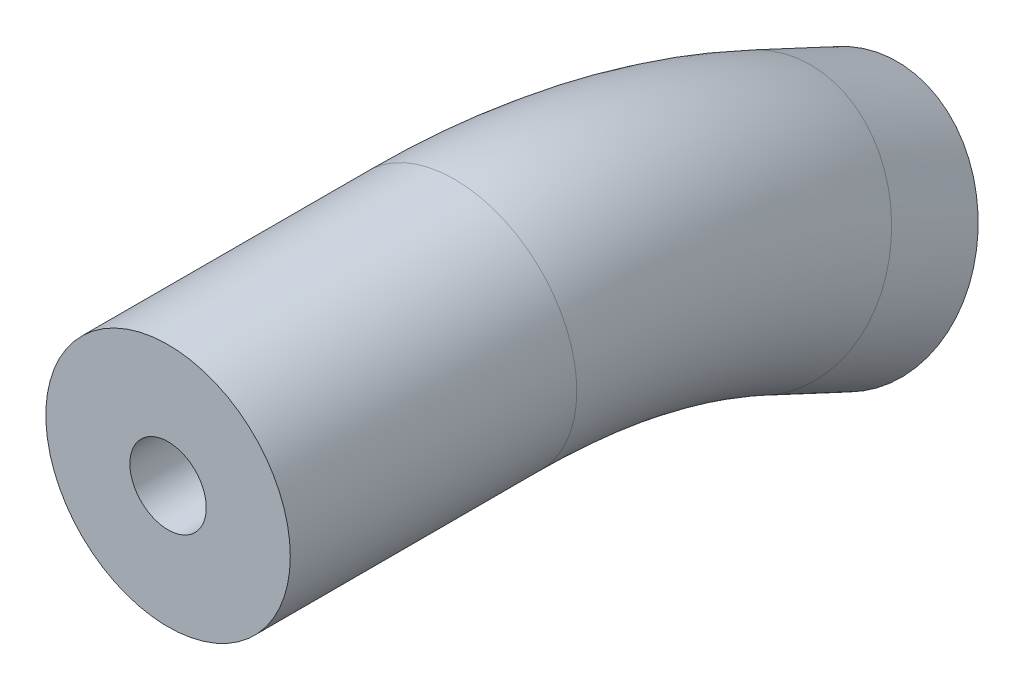
ISO-10303-21;
HEADER;
FILE_DESCRIPTION(('STEP AP214'),'2;1');
FILE_NAME('part.step','',(''),(''),'','','');
FILE_SCHEMA(('AUTOMOTIVE_DESIGN { 1 0 10303 214 1 1 1 1 }'));
ENDSEC;
DATA;
#1=APPLICATION_CONTEXT('core data for automotive mechanical design processes');
#2=APPLICATION_PROTOCOL_DEFINITION('international standard','automotive_design',2000,#1);
#3=PRODUCT_CONTEXT('',#1,'mechanical');
#4=PRODUCT('Part','Part','',(#3));
#5=PRODUCT_RELATED_PRODUCT_CATEGORY('part','',(#4));
#6=PRODUCT_DEFINITION_FORMATION('','',#4);
#7=PRODUCT_DEFINITION_CONTEXT('part definition',#1,'design');
#8=PRODUCT_DEFINITION('design','',#6,#7);
#9=PRODUCT_DEFINITION_SHAPE('','',#8);
#10=(LENGTH_UNIT() NAMED_UNIT(*) SI_UNIT(.MILLI.,.METRE.));
#11=(NAMED_UNIT(*) PLANE_ANGLE_UNIT() SI_UNIT($,.RADIAN.));
#12=(NAMED_UNIT(*) SI_UNIT($,.STERADIAN.) SOLID_ANGLE_UNIT());
#13=UNCERTAINTY_MEASURE_WITH_UNIT(LENGTH_MEASURE(1.E-05),#10,'distance_accuracy_value','');
#14=(GEOMETRIC_REPRESENTATION_CONTEXT(3) GLOBAL_UNCERTAINTY_ASSIGNED_CONTEXT((#13)) GLOBAL_UNIT_ASSIGNED_CONTEXT((#10,
#11,#12)) REPRESENTATION_CONTEXT('',''));
#15=CARTESIAN_POINT('',(0.,0.,0.));
#16=DIRECTION('',(0.,0.,1.));
#17=DIRECTION('',(1.,0.,0.));
#18=AXIS2_PLACEMENT_3D('',#15,#16,#17);
#19=CARTESIAN_POINT('',(8.125,-4.2,-8.02));
#20=DIRECTION('',(0.,0.,-1.));
#21=DIRECTION('',(-1.,0.,0.));
#22=AXIS2_PLACEMENT_3D('',#19,#20,#21);
#23=CYLINDRICAL_SURFACE('',#22,0.2);
#24=CARTESIAN_POINT('',(8.125,-4.2,-9.52));
#25=DIRECTION('',(0.,0.,1.));
#26=DIRECTION('',(1.,0.,0.));
#27=AXIS2_PLACEMENT_3D('',#24,#25,#26);
#28=CIRCLE('',#27,0.2);
#29=CARTESIAN_POINT('',(8.325,-4.2,-9.52));
#30=VERTEX_POINT('',#29);
#31=EDGE_CURVE('E62',#30,#30,#28,.T.);
#32=ORIENTED_EDGE('',*,*,#31,.F.);
#33=EDGE_LOOP('',(#32));
#34=FACE_BOUND('',#33,.T.);
#35=CARTESIAN_POINT('',(8.125,-4.2,-8.02));
#36=DIRECTION('',(0.,0.,-1.));
#37=DIRECTION('',(-1.,0.,0.));
#38=AXIS2_PLACEMENT_3D('',#35,#36,#37);
#39=CIRCLE('',#38,0.2);
#40=CARTESIAN_POINT('',(7.925,-4.2,-8.02));
#41=VERTEX_POINT('',#40);
#42=EDGE_CURVE('E56',#41,#41,#39,.T.);
#43=ORIENTED_EDGE('',*,*,#42,.F.);
#44=EDGE_LOOP('',(#43));
#45=FACE_BOUND('',#44,.T.);
#46=ADVANCED_FACE('F17',(#34,#45),#23,.F.);
#47=CARTESIAN_POINT('',(8.125,-7.97099703639013,-9.52));
#48=DIRECTION('',(1.,0.,0.));
#49=DIRECTION('',(0.,0.,-1.));
#50=AXIS2_PLACEMENT_3D('',#47,#48,#49);
#51=TOROIDAL_SURFACE('',#50,3.77099703639014,0.200000000000004);
#52=ORIENTED_EDGE('',*,*,#31,.T.);
#53=EDGE_LOOP('',(#52));
#54=FACE_BOUND('',#53,.T.);
#55=CARTESIAN_POINT('',(8.12500000000001,-4.55331305739741,-11.1136922125105));
#56=DIRECTION('',(0.,0.422618261740958,0.906307787036529));
#57=DIRECTION('',(0.,-0.906307787036529,0.422618261740959));
#58=AXIS2_PLACEMENT_3D('',#55,#56,#57);
#59=CIRCLE('',#58,0.200000000000016);
#60=CARTESIAN_POINT('',(8.12500000000001,-4.73457461480473,-11.0291685601623));
#61=VERTEX_POINT('',#60);
#62=EDGE_CURVE('E53',#61,#61,#59,.T.);
#63=ORIENTED_EDGE('',*,*,#62,.F.);
#64=EDGE_LOOP('',(#63));
#65=FACE_BOUND('',#64,.T.);
#66=ADVANCED_FACE('F66',(#54,#65),#51,.F.);
#67=CARTESIAN_POINT('',(8.766,-3.559,-8.02));
#68=DIRECTION('',(0.,0.,1.));
#69=DIRECTION('',(-1.,0.,0.));
#70=AXIS2_PLACEMENT_3D('',#67,#68,#69);
#71=PLANE('',#70);
#72=ORIENTED_EDGE('',*,*,#42,.T.);
#73=EDGE_LOOP('',(#72));
#74=FACE_BOUND('',#73,.T.);
#75=CARTESIAN_POINT('',(8.125,-4.2,-8.02));
#76=DIRECTION('',(0.,0.,1.));
#77=DIRECTION('',(1.,0.,0.));
#78=AXIS2_PLACEMENT_3D('',#75,#76,#77);
#79=CIRCLE('',#78,0.64);
#80=CARTESIAN_POINT('',(8.765,-4.2,-8.02));
#81=VERTEX_POINT('',#80);
#82=EDGE_CURVE('E48',#81,#81,#79,.F.);
#83=ORIENTED_EDGE('',*,*,#82,.F.);
#84=EDGE_LOOP('',(#83));
#85=FACE_BOUND('',#84,.T.);
#86=ADVANCED_FACE('F74',(#74,#85),#71,.T.);
#87=CARTESIAN_POINT('',(8.12500000000001,-4.55331305739741,-11.1136922125105));
#88=DIRECTION('',(0.,-0.422618261740959,-0.906307787036529));
#89=DIRECTION('',(0.,0.906307787036529,-0.422618261740959));
#90=AXIS2_PLACEMENT_3D('',#87,#88,#89);
#91=CYLINDRICAL_SURFACE('',#90,0.200000000000016);
#92=CARTESIAN_POINT('',(8.12500000000002,-4.76462218847881,-11.5668461064811));
#93=DIRECTION('',(0.,-0.422618261740959,-0.906307787036529));
#94=DIRECTION('',(0.,0.906307787036529,-0.422618261740959));
#95=AXIS2_PLACEMENT_3D('',#92,#93,#94);
#96=CIRCLE('',#95,0.200000000000016);
#97=CARTESIAN_POINT('',(8.12500000000002,-4.58336063107148,-11.6513697588293));
#98=VERTEX_POINT('',#97);
#99=EDGE_CURVE('E45',#98,#98,#96,.F.);
#100=ORIENTED_EDGE('',*,*,#99,.F.);
#101=EDGE_LOOP('',(#100));
#102=FACE_BOUND('',#101,.T.);
#103=ORIENTED_EDGE('',*,*,#62,.T.);
#104=EDGE_LOOP('',(#103));
#105=FACE_BOUND('',#104,.T.);
#106=ADVANCED_FACE('F77',(#102,#105),#91,.F.);
#107=CARTESIAN_POINT('',(8.125,-4.2,-9.52));
#108=DIRECTION('',(0.,0.,1.));
#109=DIRECTION('',(1.,0.,0.));
#110=AXIS2_PLACEMENT_3D('',#107,#108,#109);
#111=CYLINDRICAL_SURFACE('',#110,0.64);
#112=ORIENTED_EDGE('',*,*,#82,.T.);
#113=EDGE_LOOP('',(#112));
#114=FACE_BOUND('',#113,.T.);
#115=CARTESIAN_POINT('',(8.125,-4.2,-9.52));
#116=DIRECTION('',(0.,0.,-1.));
#117=DIRECTION('',(-1.,0.,0.));
#118=AXIS2_PLACEMENT_3D('',#115,#116,#117);
#119=CIRCLE('',#118,0.639999999999999);
#120=CARTESIAN_POINT('',(7.485,-4.2,-9.52));
#121=VERTEX_POINT('',#120);
#122=EDGE_CURVE('E36',#121,#121,#119,.T.);
#123=ORIENTED_EDGE('',*,*,#122,.F.);
#124=EDGE_LOOP('',(#123));
#125=FACE_BOUND('',#124,.T.);
#126=ADVANCED_FACE('F81',(#114,#125),#111,.T.);
#127=CARTESIAN_POINT('',(7.484,-4.18367889700396,-11.8377444122497));
#128=DIRECTION('',(0.,-0.422618261740863,-0.906307787036574));
#129=DIRECTION('',(1.,0.,0.));
#130=AXIS2_PLACEMENT_3D('',#127,#128,#129);
#131=PLANE('',#130);
#132=ORIENTED_EDGE('',*,*,#99,.T.);
#133=EDGE_LOOP('',(#132));
#134=FACE_BOUND('',#133,.T.);
#135=CARTESIAN_POINT('',(8.12500000000001,-4.76462218847872,-11.5668461064811));
#136=DIRECTION('',(0.,0.422618261740778,0.906307787036613));
#137=DIRECTION('',(0.,-0.906307787036613,0.422618261740778));
#138=AXIS2_PLACEMENT_3D('',#135,#136,#137);
#139=CIRCLE('',#138,0.640000000000003);
#140=CARTESIAN_POINT('',(8.12500000000001,-5.34465917218216,-11.296370418967));
#141=VERTEX_POINT('',#140);
#142=EDGE_CURVE('E26',#141,#141,#139,.T.);
#143=ORIENTED_EDGE('',*,*,#142,.F.);
#144=EDGE_LOOP('',(#143));
#145=FACE_BOUND('',#144,.T.);
#146=ADVANCED_FACE('F41',(#134,#145),#131,.T.);
#147=CARTESIAN_POINT('',(8.12500000000004,-7.97099703645936,-9.51999999998462));
#148=DIRECTION('',(1.,0.,0.));
#149=DIRECTION('',(0.,1.,0.));
#150=AXIS2_PLACEMENT_3D('',#147,#148,#149);
#151=TOROIDAL_SURFACE('',#150,3.77099703645937,0.640000000000001);
#152=CARTESIAN_POINT('',(8.125,-4.55331305739947,-11.1136922125096));
#153=DIRECTION('',(0.,0.422618261730355,0.906307787041474));
#154=DIRECTION('',(0.,-0.906307787041474,0.422618261730355));
#155=AXIS2_PLACEMENT_3D('',#152,#153,#154);
#156=CIRCLE('',#155,0.64);
#157=CARTESIAN_POINT('',(7.485,-4.55331305740871,-11.1136922125052));
#158=VERTEX_POINT('',#157);
#159=CARTESIAN_POINT('',(8.125,-5.13335004111153,-10.8432165250153));
#160=VERTEX_POINT('',#159);
#161=EDGE_CURVE('E33',#158,#160,#156,.T.);
#162=ORIENTED_EDGE('',*,*,#161,.T.);
#163=CARTESIAN_POINT('',(8.125,-4.5533130573974,-11.1136922125105));
#164=DIRECTION('',(0.,-0.422618261740916,-0.906307787036549));
#165=DIRECTION('',(0.,0.906307787036549,-0.422618261740916));
#166=AXIS2_PLACEMENT_3D('',#163,#164,#165);
#167=CIRCLE('',#166,0.640000000000016);
#168=EDGE_CURVE('E11',#158,#160,#167,.T.);
#169=ORIENTED_EDGE('',*,*,#168,.F.);
#170=EDGE_LOOP('',(#162,#169));
#171=FACE_BOUND('',#170,.T.);
#172=ORIENTED_EDGE('',*,*,#122,.T.);
#173=EDGE_LOOP('',(#172));
#174=FACE_BOUND('',#173,.T.);
#175=ADVANCED_FACE('F38',(#171,#174),#151,.T.);
#176=CARTESIAN_POINT('',(8.12500000000001,-4.7646221884443,-11.5668461064073));
#177=DIRECTION('',(0.,0.422618261740778,0.906307787036613));
#178=DIRECTION('',(0.,-0.906307787036613,0.422618261740778));
#179=AXIS2_PLACEMENT_3D('',#176,#177,#178);
#180=CYLINDRICAL_SURFACE('',#179,0.640000000000003);
#181=ORIENTED_EDGE('',*,*,#161,.F.);
#182=ORIENTED_EDGE('',*,*,#168,.T.);
#183=EDGE_LOOP('',(#181,#182));
#184=FACE_BOUND('',#183,.T.);
#185=ORIENTED_EDGE('',*,*,#142,.T.);
#186=EDGE_LOOP('',(#185));
#187=FACE_BOUND('',#186,.T.);
#188=ADVANCED_FACE('F19',(#184,#187),#180,.T.);
#189=CLOSED_SHELL('',(#46,#66,#86,#106,#126,#146,#175,#188));
#190=MANIFOLD_SOLID_BREP('B1',#189);
#191=ADVANCED_BREP_SHAPE_REPRESENTATION('',(#18,#190),#14);
#192=SHAPE_DEFINITION_REPRESENTATION(#9,#191);
ENDSEC;
END-ISO-10303-21;
